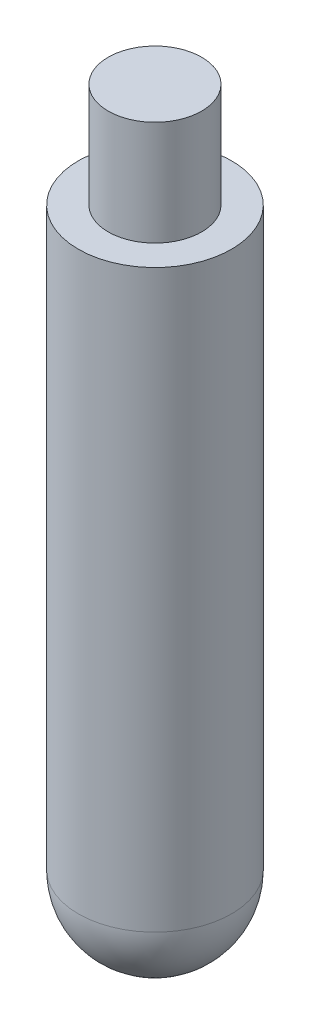
ISO-10303-21;
HEADER;
FILE_DESCRIPTION(('STEP AP214'),'2;1');
FILE_NAME('part.step','',(''),(''),'','','');
FILE_SCHEMA(('AUTOMOTIVE_DESIGN { 1 0 10303 214 1 1 1 1 }'));
ENDSEC;
DATA;
#1=APPLICATION_CONTEXT('core data for automotive mechanical design processes');
#2=APPLICATION_PROTOCOL_DEFINITION('international standard','automotive_design',2000,#1);
#3=PRODUCT_CONTEXT('',#1,'mechanical');
#4=PRODUCT('Part','Part','',(#3));
#5=PRODUCT_RELATED_PRODUCT_CATEGORY('part','',(#4));
#6=PRODUCT_DEFINITION_FORMATION('','',#4);
#7=PRODUCT_DEFINITION_CONTEXT('part definition',#1,'design');
#8=PRODUCT_DEFINITION('design','',#6,#7);
#9=PRODUCT_DEFINITION_SHAPE('','',#8);
#10=(LENGTH_UNIT() NAMED_UNIT(*) SI_UNIT(.MILLI.,.METRE.));
#11=(NAMED_UNIT(*) PLANE_ANGLE_UNIT() SI_UNIT($,.RADIAN.));
#12=(NAMED_UNIT(*) SI_UNIT($,.STERADIAN.) SOLID_ANGLE_UNIT());
#13=UNCERTAINTY_MEASURE_WITH_UNIT(LENGTH_MEASURE(1.E-05),#10,'distance_accuracy_value','');
#14=(GEOMETRIC_REPRESENTATION_CONTEXT(3) GLOBAL_UNCERTAINTY_ASSIGNED_CONTEXT((#13)) GLOBAL_UNIT_ASSIGNED_CONTEXT((#10,
#11,#12)) REPRESENTATION_CONTEXT('',''));
#15=CARTESIAN_POINT('',(0.,0.,0.));
#16=DIRECTION('',(0.,0.,1.));
#17=DIRECTION('',(1.,0.,0.));
#18=AXIS2_PLACEMENT_3D('',#15,#16,#17);
#19=CARTESIAN_POINT('',(0.,15.4,0.));
#20=DIRECTION('',(0.,-1.,0.));
#21=DIRECTION('',(0.,0.,-1.));
#22=AXIS2_PLACEMENT_3D('',#19,#20,#21);
#23=CYLINDRICAL_SURFACE('',#22,2.05);
#24=CARTESIAN_POINT('',(0.,15.4,0.));
#25=DIRECTION('',(0.,1.,0.));
#26=DIRECTION('',(0.,0.,1.));
#27=AXIS2_PLACEMENT_3D('',#24,#25,#26);
#28=CIRCLE('',#27,2.05);
#29=CARTESIAN_POINT('',(0.,15.4,2.05));
#30=VERTEX_POINT('',#29);
#31=EDGE_CURVE('E34',#30,#30,#28,.T.);
#32=ORIENTED_EDGE('',*,*,#31,.F.);
#33=EDGE_LOOP('',(#32));
#34=FACE_BOUND('',#33,.T.);
#35=CARTESIAN_POINT('',(0.,0.,0.));
#36=DIRECTION('',(0.,1.,0.));
#37=DIRECTION('',(0.,0.,1.));
#38=AXIS2_PLACEMENT_3D('',#35,#36,#37);
#39=CIRCLE('',#38,2.05);
#40=CARTESIAN_POINT('',(0.,0.,2.05));
#41=VERTEX_POINT('',#40);
#42=EDGE_CURVE('E45',#41,#41,#39,.T.);
#43=ORIENTED_EDGE('',*,*,#42,.T.);
#44=EDGE_LOOP('',(#43));
#45=FACE_BOUND('',#44,.T.);
#46=ADVANCED_FACE('F31',(#34,#45),#23,.T.);
#47=CARTESIAN_POINT('',(0.,15.4,0.));
#48=DIRECTION('',(0.,1.,0.));
#49=DIRECTION('',(0.,0.,1.));
#50=AXIS2_PLACEMENT_3D('',#47,#48,#49);
#51=PLANE('',#50);
#52=CARTESIAN_POINT('',(0.,15.4,0.));
#53=DIRECTION('',(0.,1.,0.));
#54=DIRECTION('',(0.,0.,1.));
#55=AXIS2_PLACEMENT_3D('',#52,#53,#54);
#56=CIRCLE('',#55,1.25);
#57=CARTESIAN_POINT('',(0.,15.4,1.25));
#58=VERTEX_POINT('',#57);
#59=EDGE_CURVE('E10',#58,#58,#56,.T.);
#60=ORIENTED_EDGE('',*,*,#59,.F.);
#61=EDGE_LOOP('',(#60));
#62=FACE_BOUND('',#61,.T.);
#63=ORIENTED_EDGE('',*,*,#31,.T.);
#64=EDGE_LOOP('',(#63));
#65=FACE_BOUND('',#64,.T.);
#66=ADVANCED_FACE('F61',(#62,#65),#51,.T.);
#67=CARTESIAN_POINT('',(0.,18.2,0.));
#68=DIRECTION('',(0.,-1.,0.));
#69=DIRECTION('',(0.,0.,-1.));
#70=AXIS2_PLACEMENT_3D('',#67,#68,#69);
#71=CYLINDRICAL_SURFACE('',#70,1.25);
#72=CARTESIAN_POINT('',(0.,18.2,0.));
#73=DIRECTION('',(0.,1.,0.));
#74=DIRECTION('',(0.,0.,1.));
#75=AXIS2_PLACEMENT_3D('',#72,#73,#74);
#76=CIRCLE('',#75,1.25);
#77=CARTESIAN_POINT('',(0.,18.2,1.25));
#78=VERTEX_POINT('',#77);
#79=EDGE_CURVE('E41',#78,#78,#76,.T.);
#80=ORIENTED_EDGE('',*,*,#79,.F.);
#81=EDGE_LOOP('',(#80));
#82=FACE_BOUND('',#81,.T.);
#83=ORIENTED_EDGE('',*,*,#59,.T.);
#84=EDGE_LOOP('',(#83));
#85=FACE_BOUND('',#84,.T.);
#86=ADVANCED_FACE('F57',(#82,#85),#71,.T.);
#87=CARTESIAN_POINT('',(0.,18.2,0.));
#88=DIRECTION('',(0.,1.,0.));
#89=DIRECTION('',(0.,0.,1.));
#90=AXIS2_PLACEMENT_3D('',#87,#88,#89);
#91=PLANE('',#90);
#92=ORIENTED_EDGE('',*,*,#79,.T.);
#93=EDGE_LOOP('',(#92));
#94=FACE_BOUND('',#93,.T.);
#95=ADVANCED_FACE('F52',(#94),#91,.T.);
#96=CARTESIAN_POINT('',(0.,0.,0.));
#97=DIRECTION('',(0.,0.,-1.));
#98=DIRECTION('',(-1.,0.,0.));
#99=AXIS2_PLACEMENT_3D('',#96,#97,#98);
#100=SPHERICAL_SURFACE('',#99,2.05);
#101=CARTESIAN_POINT('',(0.,0.,0.));
#102=DIRECTION('',(0.,1.,0.));
#103=DIRECTION('',(0.,0.,1.));
#104=AXIS2_PLACEMENT_3D('',#101,#102,#103);
#105=SPHERICAL_SURFACE('',#104,2.05);
#106=ORIENTED_EDGE('',*,*,#42,.F.);
#107=EDGE_LOOP('',(#106));
#108=FACE_BOUND('',#107,.T.);
#109=ADVANCED_FACE('F50',(#108),#105,.T.);
#110=CLOSED_SHELL('',(#46,#66,#86,#95,#109));
#111=MANIFOLD_SOLID_BREP('B2',#110);
#112=ADVANCED_BREP_SHAPE_REPRESENTATION('',(#18,#111),#14);
#113=SHAPE_DEFINITION_REPRESENTATION(#9,#112);
ENDSEC;
END-ISO-10303-21;
